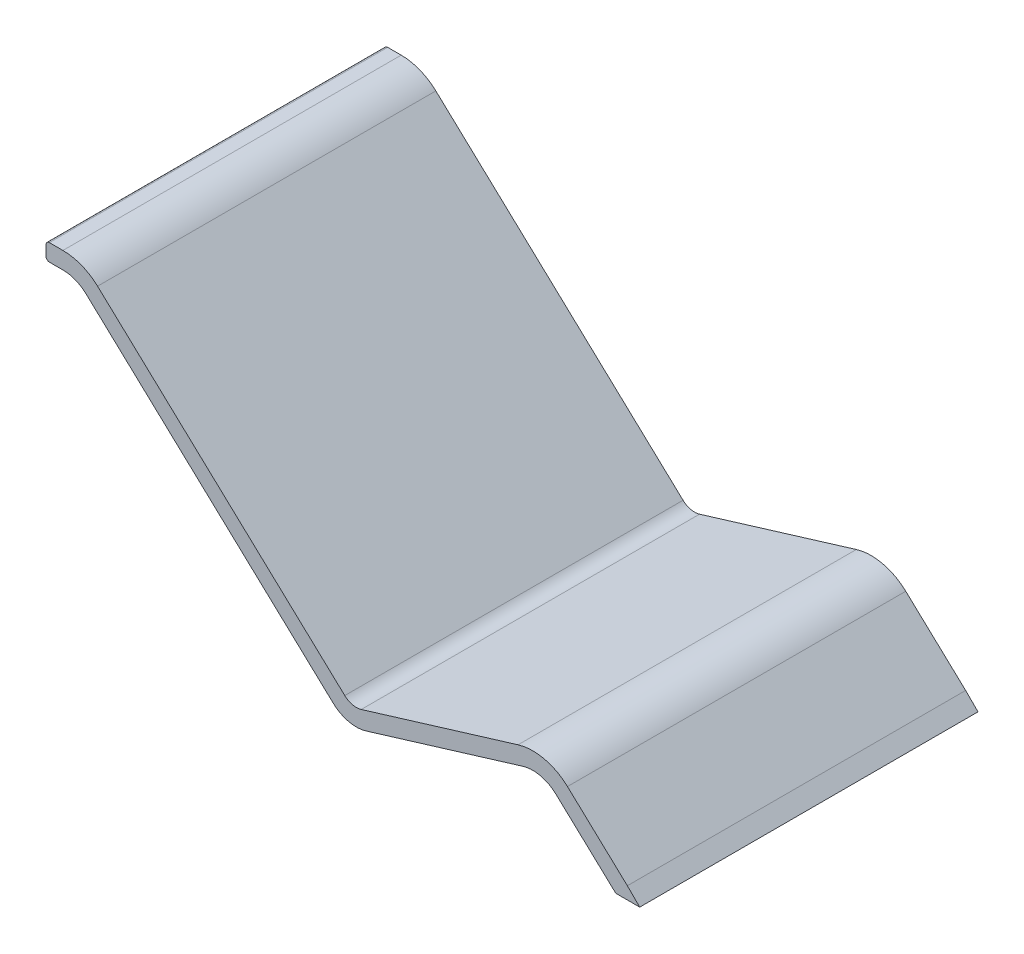
ISO-10303-21;
HEADER;
FILE_DESCRIPTION(('STEP AP214'),'2;1');
FILE_NAME('part.step','',(''),(''),'','','');
FILE_SCHEMA(('AUTOMOTIVE_DESIGN { 1 0 10303 214 1 1 1 1 }'));
ENDSEC;
DATA;
#1=APPLICATION_CONTEXT('core data for automotive mechanical design processes');
#2=APPLICATION_PROTOCOL_DEFINITION('international standard','automotive_design',2000,#1);
#3=PRODUCT_CONTEXT('',#1,'mechanical');
#4=PRODUCT('Part','Part','',(#3));
#5=PRODUCT_RELATED_PRODUCT_CATEGORY('part','',(#4));
#6=PRODUCT_DEFINITION_FORMATION('','',#4);
#7=PRODUCT_DEFINITION_CONTEXT('part definition',#1,'design');
#8=PRODUCT_DEFINITION('design','',#6,#7);
#9=PRODUCT_DEFINITION_SHAPE('','',#8);
#10=(LENGTH_UNIT() NAMED_UNIT(*) SI_UNIT(.MILLI.,.METRE.));
#11=(NAMED_UNIT(*) PLANE_ANGLE_UNIT() SI_UNIT($,.RADIAN.));
#12=(NAMED_UNIT(*) SI_UNIT($,.STERADIAN.) SOLID_ANGLE_UNIT());
#13=UNCERTAINTY_MEASURE_WITH_UNIT(LENGTH_MEASURE(1.E-05),#10,'distance_accuracy_value','');
#14=(GEOMETRIC_REPRESENTATION_CONTEXT(3) GLOBAL_UNCERTAINTY_ASSIGNED_CONTEXT((#13)) GLOBAL_UNIT_ASSIGNED_CONTEXT((#10,
#11,#12)) REPRESENTATION_CONTEXT('',''));
#15=CARTESIAN_POINT('',(0.,0.,0.));
#16=DIRECTION('',(0.,0.,1.));
#17=DIRECTION('',(1.,0.,0.));
#18=AXIS2_PLACEMENT_3D('',#15,#16,#17);
#19=CARTESIAN_POINT('',(54.7855117849043,6.24985670010874,100.));
#20=DIRECTION('',(0.,0.,-1.));
#21=DIRECTION('',(-1.,0.,0.));
#22=AXIS2_PLACEMENT_3D('',#19,#20,#21);
#23=CYLINDRICAL_SURFACE('',#22,10.);
#24=CARTESIAN_POINT('',(54.7855117849043,6.24985670010874,0.));
#25=DIRECTION('',(0.,0.,-1.));
#26=DIRECTION('',(1.,0.,0.));
#27=AXIS2_PLACEMENT_3D('',#24,#25,#26);
#28=CIRCLE('',#27,10.);
#29=CARTESIAN_POINT('',(51.8690205468538,15.8151104269251,0.));
#30=VERTEX_POINT('',#29);
#31=CARTESIAN_POINT('',(61.6110188869458,13.5582390655833,0.));
#32=VERTEX_POINT('',#31);
#33=EDGE_CURVE('E195',#30,#32,#28,.T.);
#34=ORIENTED_EDGE('',*,*,#33,.T.);
#35=DIRECTION('',(0.,0.,-1.));
#36=VECTOR('',#35,1.);
#37=CARTESIAN_POINT('',(61.6110188869458,13.5582390655833,100.));
#38=LINE('',#37,#36);
#39=CARTESIAN_POINT('',(61.6110188869458,13.5582390655833,100.));
#40=VERTEX_POINT('',#39);
#41=EDGE_CURVE('E11',#40,#32,#38,.T.);
#42=ORIENTED_EDGE('',*,*,#41,.F.);
#43=CARTESIAN_POINT('',(54.7855117849043,6.24985670010874,100.));
#44=DIRECTION('',(0.,0.,-1.));
#45=DIRECTION('',(1.,0.,0.));
#46=AXIS2_PLACEMENT_3D('',#43,#44,#45);
#47=CIRCLE('',#46,10.);
#48=CARTESIAN_POINT('',(51.8690205468538,15.8151104269251,100.));
#49=VERTEX_POINT('',#48);
#50=EDGE_CURVE('E231',#49,#40,#47,.T.);
#51=ORIENTED_EDGE('',*,*,#50,.F.);
#52=DIRECTION('',(0.,0.,-1.));
#53=VECTOR('',#52,1.);
#54=CARTESIAN_POINT('',(51.8690205468538,15.8151104269251,100.));
#55=LINE('',#54,#53);
#56=EDGE_CURVE('E191',#49,#30,#55,.T.);
#57=ORIENTED_EDGE('',*,*,#56,.T.);
#58=EDGE_LOOP('',(#34,#42,#51,#57));
#59=FACE_BOUND('',#58,.T.);
#60=ADVANCED_FACE('F33',(#59),#23,.F.);
#61=CARTESIAN_POINT('',(61.6110188869458,13.5582390655833,100.));
#62=DIRECTION('',(0.682550710204155,0.730838236547461,0.));
#63=DIRECTION('',(-0.730838236547461,0.682550710204155,0.));
#64=AXIS2_PLACEMENT_3D('',#61,#62,#63);
#65=PLANE('',#64);
#66=DIRECTION('',(0.730838236547461,-0.682550710204155,0.));
#67=VECTOR('',#66,1.);
#68=CARTESIAN_POINT('',(61.6110188869458,13.5582390655833,0.));
#69=LINE('',#68,#67);
#70=CARTESIAN_POINT('',(79.3166694573222,-2.97757387782191,0.));
#71=VERTEX_POINT('',#70);
#72=EDGE_CURVE('E198',#32,#71,#69,.T.);
#73=ORIENTED_EDGE('',*,*,#72,.T.);
#74=DIRECTION('',(0.,0.,-1.));
#75=VECTOR('',#74,1.);
#76=CARTESIAN_POINT('',(79.3166694573222,-2.97757387782191,100.));
#77=LINE('',#76,#75);
#78=CARTESIAN_POINT('',(79.3166694573222,-2.97757387782191,100.));
#79=VERTEX_POINT('',#78);
#80=EDGE_CURVE('E41',#79,#71,#77,.T.);
#81=ORIENTED_EDGE('',*,*,#80,.F.);
#82=DIRECTION('',(0.730838236547461,-0.682550710204155,0.));
#83=VECTOR('',#82,1.);
#84=CARTESIAN_POINT('',(61.6110188869458,13.5582390655833,100.));
#85=LINE('',#84,#83);
#86=EDGE_CURVE('E125',#40,#79,#85,.T.);
#87=ORIENTED_EDGE('',*,*,#86,.F.);
#88=ORIENTED_EDGE('',*,*,#41,.T.);
#89=EDGE_LOOP('',(#73,#81,#87,#88));
#90=FACE_BOUND('',#89,.T.);
#91=ADVANCED_FACE('F344',(#90),#65,.F.);
#92=CARTESIAN_POINT('',(79.3166694573222,-2.97757387782191,100.));
#93=DIRECTION('',(-1.52068713405159E-13,1.,0.));
#94=DIRECTION('',(-1.,-1.52068713405159E-13,0.));
#95=AXIS2_PLACEMENT_3D('',#92,#93,#94);
#96=PLANE('',#95);
#97=DIRECTION('',(1.,1.52068713405159E-13,0.));
#98=VECTOR('',#97,1.);
#99=CARTESIAN_POINT('',(79.3166694573222,-2.97757387782191,0.));
#100=LINE('',#99,#98);
#101=CARTESIAN_POINT('',(86.3836141910782,-2.97757387782084,0.));
#102=VERTEX_POINT('',#101);
#103=EDGE_CURVE('E200',#71,#102,#100,.T.);
#104=ORIENTED_EDGE('',*,*,#103,.T.);
#105=DIRECTION('',(0.,0.,-1.));
#106=VECTOR('',#105,1.);
#107=CARTESIAN_POINT('',(86.3836141910782,-2.97757387782084,100.));
#108=LINE('',#107,#106);
#109=CARTESIAN_POINT('',(86.3836141910782,-2.97757387782084,100.));
#110=VERTEX_POINT('',#109);
#111=EDGE_CURVE('E271',#110,#102,#108,.T.);
#112=ORIENTED_EDGE('',*,*,#111,.F.);
#113=DIRECTION('',(1.,1.52068713405159E-13,0.));
#114=VECTOR('',#113,1.);
#115=CARTESIAN_POINT('',(79.3166694573222,-2.97757387782191,100.));
#116=LINE('',#115,#114);
#117=EDGE_CURVE('E279',#79,#110,#116,.T.);
#118=ORIENTED_EDGE('',*,*,#117,.F.);
#119=ORIENTED_EDGE('',*,*,#80,.T.);
#120=EDGE_LOOP('',(#104,#112,#118,#119));
#121=FACE_BOUND('',#120,.T.);
#122=ADVANCED_FACE('F277',(#121),#96,.F.);
#123=CARTESIAN_POINT('',(82.729423008343,0.676617304915393,100.));
#124=DIRECTION('',(-0.707106781186648,-0.707106781186447,0.));
#125=DIRECTION('',(0.707106781186447,-0.707106781186648,0.));
#126=AXIS2_PLACEMENT_3D('',#123,#124,#125);
#127=PLANE('',#126);
#128=DIRECTION('',(-0.707106781186447,0.707106781186648,0.));
#129=VECTOR('',#128,1.);
#130=CARTESIAN_POINT('',(82.729423008343,0.676617304915393,0.));
#131=LINE('',#130,#129);
#132=CARTESIAN_POINT('',(82.729423008343,0.676617304915393,0.));
#133=VERTEX_POINT('',#132);
#134=EDGE_CURVE('E202',#102,#133,#131,.T.);
#135=ORIENTED_EDGE('',*,*,#134,.T.);
#136=DIRECTION('',(0.,0.,-1.));
#137=VECTOR('',#136,1.);
#138=CARTESIAN_POINT('',(82.729423008343,0.676617304915393,100.));
#139=LINE('',#138,#137);
#140=CARTESIAN_POINT('',(82.729423008343,0.676617304915393,100.));
#141=VERTEX_POINT('',#140);
#142=EDGE_CURVE('E268',#141,#133,#139,.T.);
#143=ORIENTED_EDGE('',*,*,#142,.F.);
#144=DIRECTION('',(-0.707106781186447,0.707106781186648,0.));
#145=VECTOR('',#144,1.);
#146=CARTESIAN_POINT('',(82.729423008343,0.676617304915393,100.));
#147=LINE('',#146,#145);
#148=EDGE_CURVE('E297',#110,#141,#147,.T.);
#149=ORIENTED_EDGE('',*,*,#148,.F.);
#150=ORIENTED_EDGE('',*,*,#111,.T.);
#151=EDGE_LOOP('',(#135,#143,#149,#150));
#152=FACE_BOUND('',#151,.T.);
#153=ADVANCED_FACE('F288',(#152),#127,.F.);
#154=CARTESIAN_POINT('',(65.0237724379666,17.2124302483207,100.));
#155=DIRECTION('',(-0.682550710204155,-0.730838236547461,0.));
#156=DIRECTION('',(0.730838236547461,-0.682550710204155,0.));
#157=AXIS2_PLACEMENT_3D('',#154,#155,#156);
#158=PLANE('',#157);
#159=DIRECTION('',(-0.730838236547461,0.682550710204155,0.));
#160=VECTOR('',#159,1.);
#161=CARTESIAN_POINT('',(65.0237724379666,17.2124302483207,0.));
#162=LINE('',#161,#160);
#163=CARTESIAN_POINT('',(65.0237724379666,17.2124302483207,0.));
#164=VERTEX_POINT('',#163);
#165=EDGE_CURVE('E204',#133,#164,#162,.T.);
#166=ORIENTED_EDGE('',*,*,#165,.T.);
#167=DIRECTION('',(0.,0.,-1.));
#168=VECTOR('',#167,1.);
#169=CARTESIAN_POINT('',(65.0237724379666,17.2124302483207,100.));
#170=LINE('',#169,#168);
#171=CARTESIAN_POINT('',(65.0237724379666,17.2124302483207,100.));
#172=VERTEX_POINT('',#171);
#173=EDGE_CURVE('E265',#172,#164,#170,.T.);
#174=ORIENTED_EDGE('',*,*,#173,.F.);
#175=DIRECTION('',(-0.730838236547461,0.682550710204155,0.));
#176=VECTOR('',#175,1.);
#177=CARTESIAN_POINT('',(65.0237724379666,17.2124302483207,100.));
#178=LINE('',#177,#176);
#179=EDGE_CURVE('E294',#141,#172,#178,.T.);
#180=ORIENTED_EDGE('',*,*,#179,.F.);
#181=ORIENTED_EDGE('',*,*,#142,.T.);
#182=EDGE_LOOP('',(#166,#174,#180,#181));
#183=FACE_BOUND('',#182,.T.);
#184=ADVANCED_FACE('F292',(#183),#158,.F.);
#185=CARTESIAN_POINT('',(54.7855117849043,6.24985670010874,100.));
#186=DIRECTION('',(0.,0.,-1.));
#187=DIRECTION('',(-1.,0.,0.));
#188=AXIS2_PLACEMENT_3D('',#185,#186,#187);
#189=CYLINDRICAL_SURFACE('',#188,15.);
#190=CARTESIAN_POINT('',(54.7855117849043,6.24985670010874,0.));
#191=DIRECTION('',(0.,0.,1.));
#192=DIRECTION('',(1.,0.,0.));
#193=AXIS2_PLACEMENT_3D('',#190,#191,#192);
#194=CIRCLE('',#193,15.);
#195=CARTESIAN_POINT('',(50.4107749278286,20.5977372903333,0.));
#196=VERTEX_POINT('',#195);
#197=EDGE_CURVE('E206',#164,#196,#194,.T.);
#198=ORIENTED_EDGE('',*,*,#197,.T.);
#199=DIRECTION('',(0.,0.,-1.));
#200=VECTOR('',#199,1.);
#201=CARTESIAN_POINT('',(50.4107749278286,20.5977372903333,100.));
#202=LINE('',#201,#200);
#203=CARTESIAN_POINT('',(50.4107749278286,20.5977372903333,100.));
#204=VERTEX_POINT('',#203);
#205=EDGE_CURVE('E262',#204,#196,#202,.T.);
#206=ORIENTED_EDGE('',*,*,#205,.F.);
#207=CARTESIAN_POINT('',(54.7855117849043,6.24985670010874,100.));
#208=DIRECTION('',(0.,0.,1.));
#209=DIRECTION('',(1.,0.,0.));
#210=AXIS2_PLACEMENT_3D('',#207,#208,#209);
#211=CIRCLE('',#210,15.);
#212=EDGE_CURVE('E296',#172,#204,#211,.T.);
#213=ORIENTED_EDGE('',*,*,#212,.F.);
#214=ORIENTED_EDGE('',*,*,#173,.T.);
#215=EDGE_LOOP('',(#198,#206,#213,#214));
#216=FACE_BOUND('',#215,.T.);
#217=ADVANCED_FACE('F357',(#216),#189,.T.);
#218=CARTESIAN_POINT('',(4.06425619501926,6.4664638647858,100.));
#219=DIRECTION('',(0.291649123805046,-0.956525372681639,0.));
#220=DIRECTION('',(0.956525372681639,0.291649123805046,0.));
#221=AXIS2_PLACEMENT_3D('',#218,#219,#220);
#222=PLANE('',#221);
#223=DIRECTION('',(-0.956525372681639,-0.291649123805046,0.));
#224=VECTOR('',#223,1.);
#225=CARTESIAN_POINT('',(4.06425619501926,6.4664638647858,0.));
#226=LINE('',#225,#224);
#227=CARTESIAN_POINT('',(4.06425619501926,6.4664638647858,0.));
#228=VERTEX_POINT('',#227);
#229=EDGE_CURVE('E208',#196,#228,#226,.T.);
#230=ORIENTED_EDGE('',*,*,#229,.T.);
#231=DIRECTION('',(0.,0.,-1.));
#232=VECTOR('',#231,1.);
#233=CARTESIAN_POINT('',(4.06425619501926,6.4664638647858,100.));
#234=LINE('',#233,#232);
#235=CARTESIAN_POINT('',(4.06425619501926,6.4664638647858,100.));
#236=VERTEX_POINT('',#235);
#237=EDGE_CURVE('E259',#236,#228,#234,.T.);
#238=ORIENTED_EDGE('',*,*,#237,.F.);
#239=DIRECTION('',(-0.956525372681639,-0.291649123805046,0.));
#240=VECTOR('',#239,1.);
#241=CARTESIAN_POINT('',(4.06425619501926,6.4664638647858,100.));
#242=LINE('',#241,#240);
#243=EDGE_CURVE('E299',#204,#236,#242,.T.);
#244=ORIENTED_EDGE('',*,*,#243,.F.);
#245=ORIENTED_EDGE('',*,*,#205,.T.);
#246=EDGE_LOOP('',(#230,#238,#244,#245));
#247=FACE_BOUND('',#246,.T.);
#248=ADVANCED_FACE('F360',(#247),#222,.F.);
#249=CARTESIAN_POINT('',(2.60601057599403,11.249090728194,100.));
#250=DIRECTION('',(0.,0.,-1.));
#251=DIRECTION('',(-1.,0.,0.));
#252=AXIS2_PLACEMENT_3D('',#249,#250,#251);
#253=CYLINDRICAL_SURFACE('',#252,5.);
#254=CARTESIAN_POINT('',(2.60601057599403,11.249090728194,0.));
#255=DIRECTION('',(0.,0.,-1.));
#256=DIRECTION('',(-1.,0.,0.));
#257=AXIS2_PLACEMENT_3D('',#254,#255,#256);
#258=CIRCLE('',#257,5.);
#259=CARTESIAN_POINT('',(-0.806742975026728,7.59489954545668,0.));
#260=VERTEX_POINT('',#259);
#261=EDGE_CURVE('E210',#228,#260,#258,.T.);
#262=ORIENTED_EDGE('',*,*,#261,.T.);
#263=DIRECTION('',(0.,0.,-1.));
#264=VECTOR('',#263,1.);
#265=CARTESIAN_POINT('',(-0.806742975026728,7.59489954545668,100.));
#266=LINE('',#265,#264);
#267=CARTESIAN_POINT('',(-0.806742975026728,7.59489954545668,100.));
#268=VERTEX_POINT('',#267);
#269=EDGE_CURVE('E256',#268,#260,#266,.T.);
#270=ORIENTED_EDGE('',*,*,#269,.F.);
#271=CARTESIAN_POINT('',(2.60601057599403,11.249090728194,100.));
#272=DIRECTION('',(0.,0.,-1.));
#273=DIRECTION('',(-1.,0.,0.));
#274=AXIS2_PLACEMENT_3D('',#271,#272,#273);
#275=CIRCLE('',#274,5.);
#276=EDGE_CURVE('E305',#236,#268,#275,.T.);
#277=ORIENTED_EDGE('',*,*,#276,.F.);
#278=ORIENTED_EDGE('',*,*,#237,.T.);
#279=EDGE_LOOP('',(#262,#270,#277,#278));
#280=FACE_BOUND('',#279,.T.);
#281=ADVANCED_FACE('F364',(#280),#253,.F.);
#282=CARTESIAN_POINT('',(-0.806742975026728,7.59489954545667,100.));
#283=DIRECTION('',(-0.682550710204151,-0.730838236547465,0.));
#284=DIRECTION('',(0.730838236547465,-0.682550710204151,0.));
#285=AXIS2_PLACEMENT_3D('',#282,#283,#284);
#286=PLANE('',#285);
#287=DIRECTION('',(-0.730838236547465,0.682550710204151,0.));
#288=VECTOR('',#287,1.);
#289=CARTESIAN_POINT('',(-0.806742975026728,7.59489954545667,0.));
#290=LINE('',#289,#288);
#291=CARTESIAN_POINT('',(-73.8905666297733,75.8499705658718,0.));
#292=VERTEX_POINT('',#291);
#293=EDGE_CURVE('E212',#260,#292,#290,.T.);
#294=ORIENTED_EDGE('',*,*,#293,.T.);
#295=DIRECTION('',(0.,0.,-1.));
#296=VECTOR('',#295,1.);
#297=CARTESIAN_POINT('',(-73.8905666297733,75.8499705658718,100.));
#298=LINE('',#297,#296);
#299=CARTESIAN_POINT('',(-73.8905666297733,75.8499705658718,100.));
#300=VERTEX_POINT('',#299);
#301=EDGE_CURVE('E253',#300,#292,#298,.T.);
#302=ORIENTED_EDGE('',*,*,#301,.F.);
#303=DIRECTION('',(-0.730838236547465,0.682550710204151,0.));
#304=VECTOR('',#303,1.);
#305=CARTESIAN_POINT('',(-0.806742975026728,7.59489954545667,100.));
#306=LINE('',#305,#304);
#307=EDGE_CURVE('E307',#268,#300,#306,.T.);
#308=ORIENTED_EDGE('',*,*,#307,.F.);
#309=ORIENTED_EDGE('',*,*,#269,.T.);
#310=EDGE_LOOP('',(#294,#302,#308,#309));
#311=FACE_BOUND('',#310,.T.);
#312=ADVANCED_FACE('F368',(#311),#286,.F.);
#313=CARTESIAN_POINT('',(-84.1288272828355,64.8873970176598,100.));
#314=DIRECTION('',(0.,0.,-1.));
#315=DIRECTION('',(-1.,0.,0.));
#316=AXIS2_PLACEMENT_3D('',#313,#314,#315);
#317=CYLINDRICAL_SURFACE('',#316,15.);
#318=CARTESIAN_POINT('',(-84.1288272828355,64.8873970176598,0.));
#319=DIRECTION('',(0.,0.,1.));
#320=DIRECTION('',(1.,0.,0.));
#321=AXIS2_PLACEMENT_3D('',#318,#319,#320);
#322=CIRCLE('',#321,15.);
#323=CARTESIAN_POINT('',(-84.1288272828355,79.8873970176598,0.));
#324=VERTEX_POINT('',#323);
#325=EDGE_CURVE('E214',#292,#324,#322,.T.);
#326=ORIENTED_EDGE('',*,*,#325,.T.);
#327=DIRECTION('',(0.,0.,-1.));
#328=VECTOR('',#327,1.);
#329=CARTESIAN_POINT('',(-84.1288272828355,79.8873970176598,100.));
#330=LINE('',#329,#328);
#331=CARTESIAN_POINT('',(-84.1288272828355,79.8873970176598,100.));
#332=VERTEX_POINT('',#331);
#333=EDGE_CURVE('E250',#332,#324,#330,.T.);
#334=ORIENTED_EDGE('',*,*,#333,.F.);
#335=CARTESIAN_POINT('',(-84.1288272828355,64.8873970176598,100.));
#336=DIRECTION('',(0.,0.,1.));
#337=DIRECTION('',(1.,0.,0.));
#338=AXIS2_PLACEMENT_3D('',#335,#336,#337);
#339=CIRCLE('',#338,15.);
#340=EDGE_CURVE('E309',#300,#332,#339,.T.);
#341=ORIENTED_EDGE('',*,*,#340,.F.);
#342=ORIENTED_EDGE('',*,*,#301,.T.);
#343=EDGE_LOOP('',(#326,#334,#341,#342));
#344=FACE_BOUND('',#343,.T.);
#345=ADVANCED_FACE('F372',(#344),#317,.T.);
#346=CARTESIAN_POINT('',(-84.1288272828355,79.8873970176598,100.));
#347=DIRECTION('',(0.,-1.,0.));
#348=DIRECTION('',(0.,0.,-1.));
#349=AXIS2_PLACEMENT_3D('',#346,#347,#348);
#350=PLANE('',#349);
#351=DIRECTION('',(-1.,0.,0.));
#352=VECTOR('',#351,1.);
#353=CARTESIAN_POINT('',(-84.1288272828355,79.8873970176598,0.));
#354=LINE('',#353,#352);
#355=CARTESIAN_POINT('',(-88.1288272828356,79.8873970176598,0.));
#356=VERTEX_POINT('',#355);
#357=EDGE_CURVE('E216',#324,#356,#354,.T.);
#358=ORIENTED_EDGE('',*,*,#357,.T.);
#359=DIRECTION('',(0.,0.,-1.));
#360=VECTOR('',#359,1.);
#361=CARTESIAN_POINT('',(-88.1288272828356,79.8873970176598,100.));
#362=LINE('',#361,#360);
#363=CARTESIAN_POINT('',(-88.1288272828356,79.8873970176598,100.));
#364=VERTEX_POINT('',#363);
#365=EDGE_CURVE('E247',#364,#356,#362,.T.);
#366=ORIENTED_EDGE('',*,*,#365,.F.);
#367=DIRECTION('',(-1.,0.,0.));
#368=VECTOR('',#367,1.);
#369=CARTESIAN_POINT('',(-84.1288272828355,79.8873970176598,100.));
#370=LINE('',#369,#368);
#371=EDGE_CURVE('E311',#332,#364,#370,.T.);
#372=ORIENTED_EDGE('',*,*,#371,.F.);
#373=ORIENTED_EDGE('',*,*,#333,.T.);
#374=EDGE_LOOP('',(#358,#366,#372,#373));
#375=FACE_BOUND('',#374,.T.);
#376=ADVANCED_FACE('F376',(#375),#350,.F.);
#377=CARTESIAN_POINT('',(-88.1288272828356,78.8873970176598,100.));
#378=DIRECTION('',(0.,0.,-1.));
#379=DIRECTION('',(-1.,0.,0.));
#380=AXIS2_PLACEMENT_3D('',#377,#378,#379);
#381=CYLINDRICAL_SURFACE('',#380,1.);
#382=CARTESIAN_POINT('',(-88.1288272828356,78.8873970176598,0.));
#383=DIRECTION('',(0.,0.,1.));
#384=DIRECTION('',(1.,0.,0.));
#385=AXIS2_PLACEMENT_3D('',#382,#383,#384);
#386=CIRCLE('',#385,1.);
#387=CARTESIAN_POINT('',(-89.1288272828356,78.8873970176598,0.));
#388=VERTEX_POINT('',#387);
#389=EDGE_CURVE('E218',#356,#388,#386,.T.);
#390=ORIENTED_EDGE('',*,*,#389,.T.);
#391=DIRECTION('',(0.,0.,-1.));
#392=VECTOR('',#391,1.);
#393=CARTESIAN_POINT('',(-89.1288272828356,78.8873970176598,100.));
#394=LINE('',#393,#392);
#395=CARTESIAN_POINT('',(-89.1288272828356,78.8873970176598,100.));
#396=VERTEX_POINT('',#395);
#397=EDGE_CURVE('E244',#396,#388,#394,.T.);
#398=ORIENTED_EDGE('',*,*,#397,.F.);
#399=CARTESIAN_POINT('',(-88.1288272828356,78.8873970176598,100.));
#400=DIRECTION('',(0.,0.,1.));
#401=DIRECTION('',(1.,0.,0.));
#402=AXIS2_PLACEMENT_3D('',#399,#400,#401);
#403=CIRCLE('',#402,1.);
#404=EDGE_CURVE('E313',#364,#396,#403,.T.);
#405=ORIENTED_EDGE('',*,*,#404,.F.);
#406=ORIENTED_EDGE('',*,*,#365,.T.);
#407=EDGE_LOOP('',(#390,#398,#405,#406));
#408=FACE_BOUND('',#407,.T.);
#409=ADVANCED_FACE('F380',(#408),#381,.T.);
#410=CARTESIAN_POINT('',(-89.1288272828356,78.8873970176598,100.));
#411=DIRECTION('',(1.,0.,0.));
#412=DIRECTION('',(0.,0.,-1.));
#413=AXIS2_PLACEMENT_3D('',#410,#411,#412);
#414=PLANE('',#413);
#415=DIRECTION('',(0.,-1.,0.));
#416=VECTOR('',#415,1.);
#417=CARTESIAN_POINT('',(-89.1288272828356,78.8873970176598,0.));
#418=LINE('',#417,#416);
#419=CARTESIAN_POINT('',(-89.1288272828356,75.8873970176598,0.));
#420=VERTEX_POINT('',#419);
#421=EDGE_CURVE('E220',#388,#420,#418,.T.);
#422=ORIENTED_EDGE('',*,*,#421,.T.);
#423=DIRECTION('',(0.,0.,-1.));
#424=VECTOR('',#423,1.);
#425=CARTESIAN_POINT('',(-89.1288272828356,75.8873970176598,100.));
#426=LINE('',#425,#424);
#427=CARTESIAN_POINT('',(-89.1288272828356,75.8873970176598,100.));
#428=VERTEX_POINT('',#427);
#429=EDGE_CURVE('E241',#428,#420,#426,.T.);
#430=ORIENTED_EDGE('',*,*,#429,.F.);
#431=DIRECTION('',(0.,-1.,0.));
#432=VECTOR('',#431,1.);
#433=CARTESIAN_POINT('',(-89.1288272828356,78.8873970176598,100.));
#434=LINE('',#433,#432);
#435=EDGE_CURVE('E315',#396,#428,#434,.T.);
#436=ORIENTED_EDGE('',*,*,#435,.F.);
#437=ORIENTED_EDGE('',*,*,#397,.T.);
#438=EDGE_LOOP('',(#422,#430,#436,#437));
#439=FACE_BOUND('',#438,.T.);
#440=ADVANCED_FACE('F384',(#439),#414,.F.);
#441=CARTESIAN_POINT('',(-88.1288272828356,75.8873970176598,100.));
#442=DIRECTION('',(0.,0.,-1.));
#443=DIRECTION('',(-1.,0.,0.));
#444=AXIS2_PLACEMENT_3D('',#441,#442,#443);
#445=CYLINDRICAL_SURFACE('',#444,1.);
#446=CARTESIAN_POINT('',(-88.1288272828356,75.8873970176598,0.));
#447=DIRECTION('',(0.,0.,1.));
#448=DIRECTION('',(-1.,0.,0.));
#449=AXIS2_PLACEMENT_3D('',#446,#447,#448);
#450=CIRCLE('',#449,1.);
#451=CARTESIAN_POINT('',(-88.1288272828356,74.8873970176598,0.));
#452=VERTEX_POINT('',#451);
#453=EDGE_CURVE('E222',#420,#452,#450,.T.);
#454=ORIENTED_EDGE('',*,*,#453,.T.);
#455=DIRECTION('',(0.,0.,-1.));
#456=VECTOR('',#455,1.);
#457=CARTESIAN_POINT('',(-88.1288272828356,74.8873970176598,100.));
#458=LINE('',#457,#456);
#459=CARTESIAN_POINT('',(-88.1288272828356,74.8873970176598,100.));
#460=VERTEX_POINT('',#459);
#461=EDGE_CURVE('E238',#460,#452,#458,.T.);
#462=ORIENTED_EDGE('',*,*,#461,.F.);
#463=CARTESIAN_POINT('',(-88.1288272828356,75.8873970176598,100.));
#464=DIRECTION('',(0.,0.,1.));
#465=DIRECTION('',(-1.,0.,0.));
#466=AXIS2_PLACEMENT_3D('',#463,#464,#465);
#467=CIRCLE('',#466,1.);
#468=EDGE_CURVE('E317',#428,#460,#467,.T.);
#469=ORIENTED_EDGE('',*,*,#468,.F.);
#470=ORIENTED_EDGE('',*,*,#429,.T.);
#471=EDGE_LOOP('',(#454,#462,#469,#470));
#472=FACE_BOUND('',#471,.T.);
#473=ADVANCED_FACE('F388',(#472),#445,.T.);
#474=CARTESIAN_POINT('',(-84.1288272828355,74.8873970176598,100.));
#475=DIRECTION('',(0.,1.,0.));
#476=DIRECTION('',(0.,0.,1.));
#477=AXIS2_PLACEMENT_3D('',#474,#475,#476);
#478=PLANE('',#477);
#479=DIRECTION('',(1.,0.,0.));
#480=VECTOR('',#479,1.);
#481=CARTESIAN_POINT('',(-84.1288272828355,74.8873970176598,0.));
#482=LINE('',#481,#480);
#483=CARTESIAN_POINT('',(-84.1288272828355,74.8873970176598,0.));
#484=VERTEX_POINT('',#483);
#485=EDGE_CURVE('E224',#452,#484,#482,.T.);
#486=ORIENTED_EDGE('',*,*,#485,.T.);
#487=DIRECTION('',(0.,0.,-1.));
#488=VECTOR('',#487,1.);
#489=CARTESIAN_POINT('',(-84.1288272828355,74.8873970176598,100.));
#490=LINE('',#489,#488);
#491=CARTESIAN_POINT('',(-84.1288272828355,74.8873970176598,100.));
#492=VERTEX_POINT('',#491);
#493=EDGE_CURVE('E235',#492,#484,#490,.T.);
#494=ORIENTED_EDGE('',*,*,#493,.F.);
#495=DIRECTION('',(1.,0.,0.));
#496=VECTOR('',#495,1.);
#497=CARTESIAN_POINT('',(-84.1288272828355,74.8873970176598,100.));
#498=LINE('',#497,#496);
#499=EDGE_CURVE('E319',#460,#492,#498,.T.);
#500=ORIENTED_EDGE('',*,*,#499,.F.);
#501=ORIENTED_EDGE('',*,*,#461,.T.);
#502=EDGE_LOOP('',(#486,#494,#500,#501));
#503=FACE_BOUND('',#502,.T.);
#504=ADVANCED_FACE('F325',(#503),#478,.F.);
#505=CARTESIAN_POINT('',(-84.1288272828355,64.8873970176598,100.));
#506=DIRECTION('',(0.,0.,-1.));
#507=DIRECTION('',(-1.,0.,0.));
#508=AXIS2_PLACEMENT_3D('',#505,#506,#507);
#509=CYLINDRICAL_SURFACE('',#508,10.);
#510=CARTESIAN_POINT('',(-84.1288272828355,64.8873970176598,0.));
#511=DIRECTION('',(0.,0.,-1.));
#512=DIRECTION('',(1.,0.,0.));
#513=AXIS2_PLACEMENT_3D('',#510,#511,#512);
#514=CIRCLE('',#513,10.);
#515=CARTESIAN_POINT('',(-77.303320180794,72.1957793831344,0.));
#516=VERTEX_POINT('',#515);
#517=EDGE_CURVE('E226',#484,#516,#514,.T.);
#518=ORIENTED_EDGE('',*,*,#517,.T.);
#519=DIRECTION('',(0.,0.,-1.));
#520=VECTOR('',#519,1.);
#521=CARTESIAN_POINT('',(-77.303320180794,72.1957793831344,100.));
#522=LINE('',#521,#520);
#523=CARTESIAN_POINT('',(-77.303320180794,72.1957793831344,100.));
#524=VERTEX_POINT('',#523);
#525=EDGE_CURVE('E186',#524,#516,#522,.T.);
#526=ORIENTED_EDGE('',*,*,#525,.F.);
#527=CARTESIAN_POINT('',(-84.1288272828355,64.8873970176598,100.));
#528=DIRECTION('',(0.,0.,-1.));
#529=DIRECTION('',(1.,0.,0.));
#530=AXIS2_PLACEMENT_3D('',#527,#528,#529);
#531=CIRCLE('',#530,10.);
#532=EDGE_CURVE('E177',#492,#524,#531,.T.);
#533=ORIENTED_EDGE('',*,*,#532,.F.);
#534=ORIENTED_EDGE('',*,*,#493,.T.);
#535=EDGE_LOOP('',(#518,#526,#533,#534));
#536=FACE_BOUND('',#535,.T.);
#537=ADVANCED_FACE('F329',(#536),#509,.F.);
#538=CARTESIAN_POINT('',(-4.21949652604748,3.94070836271935,100.));
#539=DIRECTION('',(0.682550710204151,0.730838236547465,0.));
#540=DIRECTION('',(-0.730838236547465,0.682550710204151,0.));
#541=AXIS2_PLACEMENT_3D('',#538,#539,#540);
#542=PLANE('',#541);
#543=DIRECTION('',(0.730838236547465,-0.682550710204151,0.));
#544=VECTOR('',#543,1.);
#545=CARTESIAN_POINT('',(-4.21949652604748,3.94070836271935,0.));
#546=LINE('',#545,#544);
#547=CARTESIAN_POINT('',(-4.21949652604748,3.94070836271935,0.));
#548=VERTEX_POINT('',#547);
#549=EDGE_CURVE('E185',#516,#548,#546,.T.);
#550=ORIENTED_EDGE('',*,*,#549,.T.);
#551=DIRECTION('',(0.,0.,-1.));
#552=VECTOR('',#551,1.);
#553=CARTESIAN_POINT('',(-4.21949652604748,3.94070836271935,100.));
#554=LINE('',#553,#552);
#555=CARTESIAN_POINT('',(-4.21949652604748,3.94070836271935,100.));
#556=VERTEX_POINT('',#555);
#557=EDGE_CURVE('E182',#556,#548,#554,.T.);
#558=ORIENTED_EDGE('',*,*,#557,.F.);
#559=DIRECTION('',(0.730838236547465,-0.682550710204151,0.));
#560=VECTOR('',#559,1.);
#561=CARTESIAN_POINT('',(-4.21949652604748,3.94070836271935,100.));
#562=LINE('',#561,#560);
#563=EDGE_CURVE('E171',#524,#556,#562,.T.);
#564=ORIENTED_EDGE('',*,*,#563,.F.);
#565=ORIENTED_EDGE('',*,*,#525,.T.);
#566=EDGE_LOOP('',(#550,#558,#564,#565));
#567=FACE_BOUND('',#566,.T.);
#568=ADVANCED_FACE('F183',(#567),#542,.F.);
#569=CARTESIAN_POINT('',(2.60601057599403,11.249090728194,100.));
#570=DIRECTION('',(0.,0.,-1.));
#571=DIRECTION('',(-1.,0.,0.));
#572=AXIS2_PLACEMENT_3D('',#569,#570,#571);
#573=CYLINDRICAL_SURFACE('',#572,10.);
#574=CARTESIAN_POINT('',(2.60601057599403,11.249090728194,0.));
#575=DIRECTION('',(0.,0.,1.));
#576=DIRECTION('',(-1.,0.,0.));
#577=AXIS2_PLACEMENT_3D('',#574,#575,#576);
#578=CIRCLE('',#577,10.);
#579=CARTESIAN_POINT('',(5.52250181404449,1.68383700137761,0.));
#580=VERTEX_POINT('',#579);
#581=EDGE_CURVE('E111',#548,#580,#578,.T.);
#582=ORIENTED_EDGE('',*,*,#581,.T.);
#583=DIRECTION('',(0.,0.,-1.));
#584=VECTOR('',#583,1.);
#585=CARTESIAN_POINT('',(5.52250181404449,1.68383700137761,100.));
#586=LINE('',#585,#584);
#587=CARTESIAN_POINT('',(5.52250181404449,1.68383700137761,100.));
#588=VERTEX_POINT('',#587);
#589=EDGE_CURVE('E187',#588,#580,#586,.T.);
#590=ORIENTED_EDGE('',*,*,#589,.F.);
#591=CARTESIAN_POINT('',(2.60601057599403,11.249090728194,100.));
#592=DIRECTION('',(0.,0.,1.));
#593=DIRECTION('',(-1.,0.,0.));
#594=AXIS2_PLACEMENT_3D('',#591,#592,#593);
#595=CIRCLE('',#594,10.);
#596=EDGE_CURVE('E175',#556,#588,#595,.T.);
#597=ORIENTED_EDGE('',*,*,#596,.F.);
#598=ORIENTED_EDGE('',*,*,#557,.T.);
#599=EDGE_LOOP('',(#582,#590,#597,#598));
#600=FACE_BOUND('',#599,.T.);
#601=ADVANCED_FACE('F189',(#600),#573,.T.);
#602=CARTESIAN_POINT('',(5.52250181404449,1.68383700137761,100.));
#603=DIRECTION('',(-0.291649123805046,0.956525372681639,0.));
#604=DIRECTION('',(-0.956525372681639,-0.291649123805046,0.));
#605=AXIS2_PLACEMENT_3D('',#602,#603,#604);
#606=PLANE('',#605);
#607=DIRECTION('',(0.956525372681639,0.291649123805046,0.));
#608=VECTOR('',#607,1.);
#609=CARTESIAN_POINT('',(5.52250181404449,1.68383700137761,0.));
#610=LINE('',#609,#608);
#611=EDGE_CURVE('E117',#580,#30,#610,.T.);
#612=ORIENTED_EDGE('',*,*,#611,.T.);
#613=ORIENTED_EDGE('',*,*,#56,.F.);
#614=DIRECTION('',(0.956525372681639,0.291649123805046,0.));
#615=VECTOR('',#614,1.);
#616=CARTESIAN_POINT('',(5.52250181404449,1.68383700137761,100.));
#617=LINE('',#616,#615);
#618=EDGE_CURVE('E49',#588,#49,#617,.T.);
#619=ORIENTED_EDGE('',*,*,#618,.F.);
#620=ORIENTED_EDGE('',*,*,#589,.T.);
#621=EDGE_LOOP('',(#612,#613,#619,#620));
#622=FACE_BOUND('',#621,.T.);
#623=ADVANCED_FACE('F333',(#622),#606,.F.);
#624=CARTESIAN_POINT('',(54.7855117849043,6.24985670010874,100.));
#625=DIRECTION('',(0.,0.,1.));
#626=DIRECTION('',(1.,0.,0.));
#627=AXIS2_PLACEMENT_3D('',#624,#625,#626);
#628=PLANE('',#627);
#629=ORIENTED_EDGE('',*,*,#50,.T.);
#630=ORIENTED_EDGE('',*,*,#86,.T.);
#631=ORIENTED_EDGE('',*,*,#117,.T.);
#632=ORIENTED_EDGE('',*,*,#148,.T.);
#633=ORIENTED_EDGE('',*,*,#179,.T.);
#634=ORIENTED_EDGE('',*,*,#212,.T.);
#635=ORIENTED_EDGE('',*,*,#243,.T.);
#636=ORIENTED_EDGE('',*,*,#276,.T.);
#637=ORIENTED_EDGE('',*,*,#307,.T.);
#638=ORIENTED_EDGE('',*,*,#340,.T.);
#639=ORIENTED_EDGE('',*,*,#371,.T.);
#640=ORIENTED_EDGE('',*,*,#404,.T.);
#641=ORIENTED_EDGE('',*,*,#435,.T.);
#642=ORIENTED_EDGE('',*,*,#468,.T.);
#643=ORIENTED_EDGE('',*,*,#499,.T.);
#644=ORIENTED_EDGE('',*,*,#532,.T.);
#645=ORIENTED_EDGE('',*,*,#563,.T.);
#646=ORIENTED_EDGE('',*,*,#596,.T.);
#647=ORIENTED_EDGE('',*,*,#618,.T.);
#648=EDGE_LOOP('',(#629,#630,#631,#632,#633,#634,#635,#636,#637,#638,#639,#640,#641,#642,#643,
#644,#645,#646,#647));
#649=FACE_BOUND('',#648,.T.);
#650=ADVANCED_FACE('F173',(#649),#628,.T.);
#651=CARTESIAN_POINT('',(54.7855117849043,6.24985670010874,0.));
#652=DIRECTION('',(0.,0.,1.));
#653=DIRECTION('',(1.,0.,0.));
#654=AXIS2_PLACEMENT_3D('',#651,#652,#653);
#655=PLANE('',#654);
#656=ORIENTED_EDGE('',*,*,#33,.F.);
#657=ORIENTED_EDGE('',*,*,#611,.F.);
#658=ORIENTED_EDGE('',*,*,#581,.F.);
#659=ORIENTED_EDGE('',*,*,#549,.F.);
#660=ORIENTED_EDGE('',*,*,#517,.F.);
#661=ORIENTED_EDGE('',*,*,#485,.F.);
#662=ORIENTED_EDGE('',*,*,#453,.F.);
#663=ORIENTED_EDGE('',*,*,#421,.F.);
#664=ORIENTED_EDGE('',*,*,#389,.F.);
#665=ORIENTED_EDGE('',*,*,#357,.F.);
#666=ORIENTED_EDGE('',*,*,#325,.F.);
#667=ORIENTED_EDGE('',*,*,#293,.F.);
#668=ORIENTED_EDGE('',*,*,#261,.F.);
#669=ORIENTED_EDGE('',*,*,#229,.F.);
#670=ORIENTED_EDGE('',*,*,#197,.F.);
#671=ORIENTED_EDGE('',*,*,#165,.F.);
#672=ORIENTED_EDGE('',*,*,#134,.F.);
#673=ORIENTED_EDGE('',*,*,#103,.F.);
#674=ORIENTED_EDGE('',*,*,#72,.F.);
#675=EDGE_LOOP('',(#656,#657,#658,#659,#660,#661,#662,#663,#664,#665,#666,#667,#668,#669,#670,
#671,#672,#673,#674));
#676=FACE_BOUND('',#675,.T.);
#677=ADVANCED_FACE('F283',(#676),#655,.F.);
#678=CLOSED_SHELL('',(#60,#91,#122,#153,#184,#217,#248,#281,#312,#345,#376,#409,#440,#473,#504,
#537,#568,#601,#623,#650,#677));
#679=MANIFOLD_SOLID_BREP('B2',#678);
#680=ADVANCED_BREP_SHAPE_REPRESENTATION('',(#18,#679),#14);
#681=SHAPE_DEFINITION_REPRESENTATION(#9,#680);
ENDSEC;
END-ISO-10303-21;
